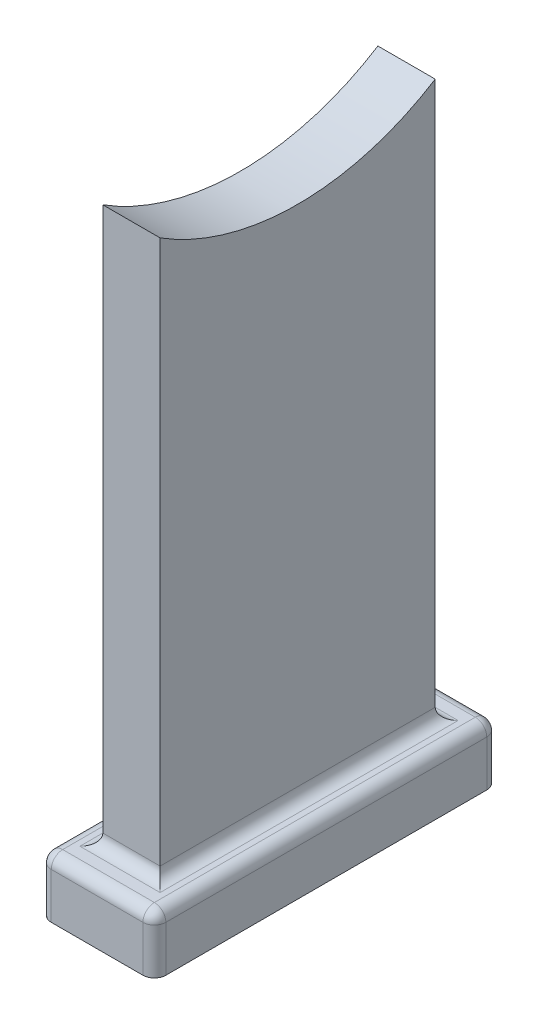
ISO-10303-21;
HEADER;
FILE_DESCRIPTION(('STEP AP214'),'2;1');
FILE_NAME('part.step','',(''),(''),'','','');
FILE_SCHEMA(('AUTOMOTIVE_DESIGN { 1 0 10303 214 1 1 1 1 }'));
ENDSEC;
DATA;
#1=APPLICATION_CONTEXT('core data for automotive mechanical design processes');
#2=APPLICATION_PROTOCOL_DEFINITION('international standard','automotive_design',2000,#1);
#3=PRODUCT_CONTEXT('',#1,'mechanical');
#4=PRODUCT('Part','Part','',(#3));
#5=PRODUCT_RELATED_PRODUCT_CATEGORY('part','',(#4));
#6=PRODUCT_DEFINITION_FORMATION('','',#4);
#7=PRODUCT_DEFINITION_CONTEXT('part definition',#1,'design');
#8=PRODUCT_DEFINITION('design','',#6,#7);
#9=PRODUCT_DEFINITION_SHAPE('','',#8);
#10=(LENGTH_UNIT() NAMED_UNIT(*) SI_UNIT(.MILLI.,.METRE.));
#11=(NAMED_UNIT(*) PLANE_ANGLE_UNIT() SI_UNIT($,.RADIAN.));
#12=(NAMED_UNIT(*) SI_UNIT($,.STERADIAN.) SOLID_ANGLE_UNIT());
#13=UNCERTAINTY_MEASURE_WITH_UNIT(LENGTH_MEASURE(1.E-05),#10,'distance_accuracy_value','');
#14=(GEOMETRIC_REPRESENTATION_CONTEXT(3) GLOBAL_UNCERTAINTY_ASSIGNED_CONTEXT((#13)) GLOBAL_UNIT_ASSIGNED_CONTEXT((#10,
#11,#12)) REPRESENTATION_CONTEXT('',''));
#15=CARTESIAN_POINT('',(0.,0.,0.));
#16=DIRECTION('',(0.,0.,1.));
#17=DIRECTION('',(1.,0.,0.));
#18=AXIS2_PLACEMENT_3D('',#15,#16,#17);
#19=CARTESIAN_POINT('',(-10.,10.,30.));
#20=DIRECTION('',(1.,0.,0.));
#21=DIRECTION('',(0.,0.,-1.));
#22=AXIS2_PLACEMENT_3D('',#19,#20,#21);
#23=PLANE('',#22);
#24=DIRECTION('',(0.,0.,1.));
#25=VECTOR('',#24,1.);
#26=CARTESIAN_POINT('',(-10.,8.,-30.));
#27=LINE('',#26,#25);
#28=CARTESIAN_POINT('',(-10.,8.,28.));
#29=VERTEX_POINT('',#28);
#30=CARTESIAN_POINT('',(-10.,8.,-28.));
#31=VERTEX_POINT('',#30);
#32=EDGE_CURVE('E267',#29,#31,#27,.F.);
#33=ORIENTED_EDGE('',*,*,#32,.T.);
#34=DIRECTION('',(0.,-1.,0.));
#35=VECTOR('',#34,1.);
#36=CARTESIAN_POINT('',(-10.,10.,-28.));
#37=LINE('',#36,#35);
#38=CARTESIAN_POINT('',(-10.,0.,-28.));
#39=VERTEX_POINT('',#38);
#40=EDGE_CURVE('E270',#31,#39,#37,.T.);
#41=ORIENTED_EDGE('',*,*,#40,.T.);
#42=DIRECTION('',(0.,0.,1.));
#43=VECTOR('',#42,1.);
#44=CARTESIAN_POINT('',(-10.,0.,30.));
#45=LINE('',#44,#43);
#46=CARTESIAN_POINT('',(-10.,0.,28.));
#47=VERTEX_POINT('',#46);
#48=EDGE_CURVE('E182',#39,#47,#45,.T.);
#49=ORIENTED_EDGE('',*,*,#48,.T.);
#50=DIRECTION('',(0.,-1.,0.));
#51=VECTOR('',#50,1.);
#52=CARTESIAN_POINT('',(-10.,10.,28.));
#53=LINE('',#52,#51);
#54=EDGE_CURVE('E264',#47,#29,#53,.F.);
#55=ORIENTED_EDGE('',*,*,#54,.T.);
#56=EDGE_LOOP('',(#33,#41,#49,#55));
#57=FACE_BOUND('',#56,.T.);
#58=ADVANCED_FACE('F45',(#57),#23,.F.);
#59=CARTESIAN_POINT('',(10.,10.,30.));
#60=DIRECTION('',(0.,0.,-1.));
#61=DIRECTION('',(-1.,0.,0.));
#62=AXIS2_PLACEMENT_3D('',#59,#60,#61);
#63=PLANE('',#62);
#64=DIRECTION('',(1.,0.,0.));
#65=VECTOR('',#64,1.);
#66=CARTESIAN_POINT('',(10.,0.,30.));
#67=LINE('',#66,#65);
#68=CARTESIAN_POINT('',(-8.,0.,30.));
#69=VERTEX_POINT('',#68);
#70=CARTESIAN_POINT('',(8.,0.,30.));
#71=VERTEX_POINT('',#70);
#72=EDGE_CURVE('E206',#69,#71,#67,.T.);
#73=ORIENTED_EDGE('',*,*,#72,.T.);
#74=DIRECTION('',(0.,-1.,0.));
#75=VECTOR('',#74,1.);
#76=CARTESIAN_POINT('',(8.,10.,30.));
#77=LINE('',#76,#75);
#78=CARTESIAN_POINT('',(8.,8.,30.));
#79=VERTEX_POINT('',#78);
#80=EDGE_CURVE('E279',#71,#79,#77,.F.);
#81=ORIENTED_EDGE('',*,*,#80,.T.);
#82=DIRECTION('',(1.,0.,0.));
#83=VECTOR('',#82,1.);
#84=CARTESIAN_POINT('',(-10.,8.,30.));
#85=LINE('',#84,#83);
#86=CARTESIAN_POINT('',(-8.,8.,30.));
#87=VERTEX_POINT('',#86);
#88=EDGE_CURVE('E276',#79,#87,#85,.F.);
#89=ORIENTED_EDGE('',*,*,#88,.T.);
#90=DIRECTION('',(0.,-1.,0.));
#91=VECTOR('',#90,1.);
#92=CARTESIAN_POINT('',(-8.,10.,30.));
#93=LINE('',#92,#91);
#94=EDGE_CURVE('E273',#87,#69,#93,.T.);
#95=ORIENTED_EDGE('',*,*,#94,.T.);
#96=EDGE_LOOP('',(#73,#81,#89,#95));
#97=FACE_BOUND('',#96,.T.);
#98=ADVANCED_FACE('F376',(#97),#63,.F.);
#99=CARTESIAN_POINT('',(10.,10.,30.));
#100=DIRECTION('',(-1.,0.,0.));
#101=DIRECTION('',(0.,0.,1.));
#102=AXIS2_PLACEMENT_3D('',#99,#100,#101);
#103=PLANE('',#102);
#104=DIRECTION('',(0.,0.,-1.));
#105=VECTOR('',#104,1.);
#106=CARTESIAN_POINT('',(10.,0.,30.));
#107=LINE('',#106,#105);
#108=CARTESIAN_POINT('',(10.,0.,28.));
#109=VERTEX_POINT('',#108);
#110=CARTESIAN_POINT('',(10.,0.,-28.));
#111=VERTEX_POINT('',#110);
#112=EDGE_CURVE('E210',#109,#111,#107,.T.);
#113=ORIENTED_EDGE('',*,*,#112,.T.);
#114=DIRECTION('',(0.,-1.,0.));
#115=VECTOR('',#114,1.);
#116=CARTESIAN_POINT('',(10.,10.,-28.));
#117=LINE('',#116,#115);
#118=CARTESIAN_POINT('',(10.,8.,-28.));
#119=VERTEX_POINT('',#118);
#120=EDGE_CURVE('E63',#111,#119,#117,.F.);
#121=ORIENTED_EDGE('',*,*,#120,.T.);
#122=DIRECTION('',(0.,0.,-1.));
#123=VECTOR('',#122,1.);
#124=CARTESIAN_POINT('',(10.,8.,30.));
#125=LINE('',#124,#123);
#126=CARTESIAN_POINT('',(10.,8.,28.));
#127=VERTEX_POINT('',#126);
#128=EDGE_CURVE('E67',#119,#127,#125,.F.);
#129=ORIENTED_EDGE('',*,*,#128,.T.);
#130=DIRECTION('',(0.,-1.,0.));
#131=VECTOR('',#130,1.);
#132=CARTESIAN_POINT('',(10.,10.,28.));
#133=LINE('',#132,#131);
#134=EDGE_CURVE('E282',#127,#109,#133,.T.);
#135=ORIENTED_EDGE('',*,*,#134,.T.);
#136=EDGE_LOOP('',(#113,#121,#129,#135));
#137=FACE_BOUND('',#136,.T.);
#138=ADVANCED_FACE('F428',(#137),#103,.F.);
#139=CARTESIAN_POINT('',(10.,10.,-30.));
#140=DIRECTION('',(0.,0.,1.));
#141=DIRECTION('',(1.,0.,0.));
#142=AXIS2_PLACEMENT_3D('',#139,#140,#141);
#143=PLANE('',#142);
#144=DIRECTION('',(-1.,0.,0.));
#145=VECTOR('',#144,1.);
#146=CARTESIAN_POINT('',(10.,0.,-30.));
#147=LINE('',#146,#145);
#148=CARTESIAN_POINT('',(8.,0.,-30.));
#149=VERTEX_POINT('',#148);
#150=CARTESIAN_POINT('',(-8.,0.,-30.));
#151=VERTEX_POINT('',#150);
#152=EDGE_CURVE('E213',#149,#151,#147,.T.);
#153=ORIENTED_EDGE('',*,*,#152,.T.);
#154=DIRECTION('',(0.,-1.,0.));
#155=VECTOR('',#154,1.);
#156=CARTESIAN_POINT('',(-8.,10.,-30.));
#157=LINE('',#156,#155);
#158=CARTESIAN_POINT('',(-8.,8.,-30.));
#159=VERTEX_POINT('',#158);
#160=EDGE_CURVE('E261',#151,#159,#157,.F.);
#161=ORIENTED_EDGE('',*,*,#160,.T.);
#162=DIRECTION('',(-1.,0.,0.));
#163=VECTOR('',#162,1.);
#164=CARTESIAN_POINT('',(10.,8.,-30.));
#165=LINE('',#164,#163);
#166=CARTESIAN_POINT('',(8.,8.,-30.));
#167=VERTEX_POINT('',#166);
#168=EDGE_CURVE('E257',#159,#167,#165,.F.);
#169=ORIENTED_EDGE('',*,*,#168,.T.);
#170=DIRECTION('',(0.,-1.,0.));
#171=VECTOR('',#170,1.);
#172=CARTESIAN_POINT('',(8.,10.,-30.));
#173=LINE('',#172,#171);
#174=EDGE_CURVE('E254',#167,#149,#173,.T.);
#175=ORIENTED_EDGE('',*,*,#174,.T.);
#176=EDGE_LOOP('',(#153,#161,#169,#175));
#177=FACE_BOUND('',#176,.T.);
#178=ADVANCED_FACE('F405',(#177),#143,.F.);
#179=CARTESIAN_POINT('',(0.,10.,0.));
#180=DIRECTION('',(0.,1.,0.));
#181=DIRECTION('',(0.,0.,1.));
#182=AXIS2_PLACEMENT_3D('',#179,#180,#181);
#183=PLANE('',#182);
#184=DIRECTION('',(0.,0.,-1.));
#185=VECTOR('',#184,1.);
#186=CARTESIAN_POINT('',(-7.,10.,0.));
#187=LINE('',#186,#185);
#188=CARTESIAN_POINT('',(-7.,10.,26.));
#189=VERTEX_POINT('',#188);
#190=CARTESIAN_POINT('',(-7.,10.,-26.));
#191=VERTEX_POINT('',#190);
#192=EDGE_CURVE('E236',#189,#191,#187,.T.);
#193=ORIENTED_EDGE('',*,*,#192,.T.);
#194=DIRECTION('',(1.,0.,0.));
#195=VECTOR('',#194,1.);
#196=CARTESIAN_POINT('',(0.,10.,-26.));
#197=LINE('',#196,#195);
#198=CARTESIAN_POINT('',(7.,10.,-26.));
#199=VERTEX_POINT('',#198);
#200=EDGE_CURVE('E239',#191,#199,#197,.T.);
#201=ORIENTED_EDGE('',*,*,#200,.T.);
#202=DIRECTION('',(0.,0.,-1.));
#203=VECTOR('',#202,1.);
#204=CARTESIAN_POINT('',(7.,10.,24.));
#205=LINE('',#204,#203);
#206=CARTESIAN_POINT('',(7.,10.,26.));
#207=VERTEX_POINT('',#206);
#208=EDGE_CURVE('E230',#199,#207,#205,.F.);
#209=ORIENTED_EDGE('',*,*,#208,.T.);
#210=DIRECTION('',(-1.,0.,0.));
#211=VECTOR('',#210,1.);
#212=CARTESIAN_POINT('',(0.,10.,26.));
#213=LINE('',#212,#211);
#214=EDGE_CURVE('E233',#207,#189,#213,.T.);
#215=ORIENTED_EDGE('',*,*,#214,.T.);
#216=EDGE_LOOP('',(#193,#201,#209,#215));
#217=FACE_BOUND('',#216,.T.);
#218=DIRECTION('',(0.,0.,-1.));
#219=VECTOR('',#218,1.);
#220=CARTESIAN_POINT('',(8.,10.,-30.));
#221=LINE('',#220,#219);
#222=CARTESIAN_POINT('',(8.,10.,28.));
#223=VERTEX_POINT('',#222);
#224=CARTESIAN_POINT('',(8.,10.,-28.));
#225=VERTEX_POINT('',#224);
#226=EDGE_CURVE('E217',#223,#225,#221,.T.);
#227=ORIENTED_EDGE('',*,*,#226,.T.);
#228=DIRECTION('',(-1.,0.,0.));
#229=VECTOR('',#228,1.);
#230=CARTESIAN_POINT('',(-10.,10.,-28.));
#231=LINE('',#230,#229);
#232=CARTESIAN_POINT('',(-8.,10.,-28.));
#233=VERTEX_POINT('',#232);
#234=EDGE_CURVE('E226',#225,#233,#231,.T.);
#235=ORIENTED_EDGE('',*,*,#234,.T.);
#236=DIRECTION('',(0.,0.,1.));
#237=VECTOR('',#236,1.);
#238=CARTESIAN_POINT('',(-8.,10.,30.));
#239=LINE('',#238,#237);
#240=CARTESIAN_POINT('',(-8.,10.,28.));
#241=VERTEX_POINT('',#240);
#242=EDGE_CURVE('E223',#233,#241,#239,.T.);
#243=ORIENTED_EDGE('',*,*,#242,.T.);
#244=DIRECTION('',(1.,0.,0.));
#245=VECTOR('',#244,1.);
#246=CARTESIAN_POINT('',(10.,10.,28.));
#247=LINE('',#246,#245);
#248=EDGE_CURVE('E220',#241,#223,#247,.T.);
#249=ORIENTED_EDGE('',*,*,#248,.T.);
#250=EDGE_LOOP('',(#227,#235,#243,#249));
#251=FACE_BOUND('',#250,.T.);
#252=ADVANCED_FACE('F366',(#217,#251),#183,.T.);
#253=CARTESIAN_POINT('',(0.,0.,0.));
#254=DIRECTION('',(0.,1.,0.));
#255=DIRECTION('',(0.,0.,1.));
#256=AXIS2_PLACEMENT_3D('',#253,#254,#255);
#257=PLANE('',#256);
#258=ORIENTED_EDGE('',*,*,#48,.F.);
#259=CARTESIAN_POINT('',(-8.,0.,-28.));
#260=DIRECTION('',(0.,1.,0.));
#261=DIRECTION('',(0.,0.,1.));
#262=AXIS2_PLACEMENT_3D('',#259,#260,#261);
#263=CIRCLE('',#262,2.);
#264=EDGE_CURVE('E11',#39,#151,#263,.F.);
#265=ORIENTED_EDGE('',*,*,#264,.T.);
#266=ORIENTED_EDGE('',*,*,#152,.F.);
#267=CARTESIAN_POINT('',(8.,0.,-28.));
#268=DIRECTION('',(0.,1.,0.));
#269=DIRECTION('',(0.,0.,1.));
#270=AXIS2_PLACEMENT_3D('',#267,#268,#269);
#271=CIRCLE('',#270,2.);
#272=EDGE_CURVE('E55',#149,#111,#271,.F.);
#273=ORIENTED_EDGE('',*,*,#272,.T.);
#274=ORIENTED_EDGE('',*,*,#112,.F.);
#275=CARTESIAN_POINT('',(8.,0.,28.));
#276=DIRECTION('',(0.,1.,0.));
#277=DIRECTION('',(0.,0.,1.));
#278=AXIS2_PLACEMENT_3D('',#275,#276,#277);
#279=CIRCLE('',#278,2.);
#280=EDGE_CURVE('E292',#109,#71,#279,.F.);
#281=ORIENTED_EDGE('',*,*,#280,.T.);
#282=ORIENTED_EDGE('',*,*,#72,.F.);
#283=CARTESIAN_POINT('',(-8.,0.,28.));
#284=DIRECTION('',(0.,1.,0.));
#285=DIRECTION('',(0.,0.,1.));
#286=AXIS2_PLACEMENT_3D('',#283,#284,#285);
#287=CIRCLE('',#286,2.);
#288=EDGE_CURVE('E289',#69,#47,#287,.F.);
#289=ORIENTED_EDGE('',*,*,#288,.T.);
#290=EDGE_LOOP('',(#258,#265,#266,#273,#274,#281,#282,#289));
#291=FACE_BOUND('',#290,.T.);
#292=ADVANCED_FACE('F386',(#291),#257,.F.);
#293=CARTESIAN_POINT('',(5.,100.,-24.));
#294=DIRECTION('',(0.,0.,1.));
#295=DIRECTION('',(1.,0.,0.));
#296=AXIS2_PLACEMENT_3D('',#293,#294,#295);
#297=PLANE('',#296);
#298=DIRECTION('',(0.,1.,0.));
#299=VECTOR('',#298,1.);
#300=CARTESIAN_POINT('',(5.,0.,-24.));
#301=LINE('',#300,#299);
#302=CARTESIAN_POINT('',(5.,12.,-24.));
#303=VERTEX_POINT('',#302);
#304=CARTESIAN_POINT('',(5.,106.934267378651,-24.));
#305=VERTEX_POINT('',#304);
#306=EDGE_CURVE('E159',#303,#305,#301,.T.);
#307=ORIENTED_EDGE('',*,*,#306,.F.);
#308=DIRECTION('',(1.,0.,0.));
#309=VECTOR('',#308,1.);
#310=CARTESIAN_POINT('',(5.,12.,-24.));
#311=LINE('',#310,#309);
#312=CARTESIAN_POINT('',(-5.,12.,-24.));
#313=VERTEX_POINT('',#312);
#314=EDGE_CURVE('E243',#303,#313,#311,.F.);
#315=ORIENTED_EDGE('',*,*,#314,.T.);
#316=DIRECTION('',(0.,1.,0.));
#317=VECTOR('',#316,1.);
#318=CARTESIAN_POINT('',(-5.,100.,-24.));
#319=LINE('',#318,#317);
#320=CARTESIAN_POINT('',(-5.,106.934267378651,-24.));
#321=VERTEX_POINT('',#320);
#322=EDGE_CURVE('E178',#313,#321,#319,.T.);
#323=ORIENTED_EDGE('',*,*,#322,.T.);
#324=DIRECTION('',(-1.,0.,0.));
#325=VECTOR('',#324,1.);
#326=CARTESIAN_POINT('',(5.,106.934267378651,-24.));
#327=LINE('',#326,#325);
#328=EDGE_CURVE('E175',#305,#321,#327,.T.);
#329=ORIENTED_EDGE('',*,*,#328,.F.);
#330=EDGE_LOOP('',(#307,#315,#323,#329));
#331=FACE_BOUND('',#330,.T.);
#332=ADVANCED_FACE('F176',(#331),#297,.F.);
#333=CARTESIAN_POINT('',(5.,145.,0.));
#334=DIRECTION('',(-1.,0.,0.));
#335=DIRECTION('',(0.,0.,1.));
#336=AXIS2_PLACEMENT_3D('',#333,#334,#335);
#337=CYLINDRICAL_SURFACE('',#336,45.);
#338=CARTESIAN_POINT('',(-5.,145.,0.));
#339=DIRECTION('',(-1.,0.,0.));
#340=DIRECTION('',(0.,0.,-1.));
#341=AXIS2_PLACEMENT_3D('',#338,#339,#340);
#342=CIRCLE('',#341,45.);
#343=CARTESIAN_POINT('',(-5.,106.934267378651,24.));
#344=VERTEX_POINT('',#343);
#345=EDGE_CURVE('E195',#321,#344,#342,.T.);
#346=ORIENTED_EDGE('',*,*,#345,.T.);
#347=DIRECTION('',(-1.,0.,0.));
#348=VECTOR('',#347,1.);
#349=CARTESIAN_POINT('',(5.,106.934267378651,24.));
#350=LINE('',#349,#348);
#351=CARTESIAN_POINT('',(5.,106.934267378651,24.));
#352=VERTEX_POINT('',#351);
#353=EDGE_CURVE('E183',#352,#344,#350,.T.);
#354=ORIENTED_EDGE('',*,*,#353,.F.);
#355=CARTESIAN_POINT('',(5.,145.,0.));
#356=DIRECTION('',(-1.,0.,0.));
#357=DIRECTION('',(0.,0.,-1.));
#358=AXIS2_PLACEMENT_3D('',#355,#356,#357);
#359=CIRCLE('',#358,45.);
#360=EDGE_CURVE('E164',#305,#352,#359,.T.);
#361=ORIENTED_EDGE('',*,*,#360,.F.);
#362=ORIENTED_EDGE('',*,*,#328,.T.);
#363=EDGE_LOOP('',(#346,#354,#361,#362));
#364=FACE_BOUND('',#363,.T.);
#365=ADVANCED_FACE('F185',(#364),#337,.F.);
#366=CARTESIAN_POINT('',(5.,106.934267378651,24.));
#367=DIRECTION('',(0.,0.,-1.));
#368=DIRECTION('',(-1.,0.,0.));
#369=AXIS2_PLACEMENT_3D('',#366,#367,#368);
#370=PLANE('',#369);
#371=DIRECTION('',(0.,-1.,0.));
#372=VECTOR('',#371,1.);
#373=CARTESIAN_POINT('',(-5.,106.934267378651,24.));
#374=LINE('',#373,#372);
#375=CARTESIAN_POINT('',(-5.,12.,24.));
#376=VERTEX_POINT('',#375);
#377=EDGE_CURVE('E199',#344,#376,#374,.T.);
#378=ORIENTED_EDGE('',*,*,#377,.T.);
#379=DIRECTION('',(-1.,0.,0.));
#380=VECTOR('',#379,1.);
#381=CARTESIAN_POINT('',(5.,12.,24.));
#382=LINE('',#381,#380);
#383=CARTESIAN_POINT('',(5.,12.,24.));
#384=VERTEX_POINT('',#383);
#385=EDGE_CURVE('E249',#376,#384,#382,.F.);
#386=ORIENTED_EDGE('',*,*,#385,.T.);
#387=DIRECTION('',(0.,-1.,0.));
#388=VECTOR('',#387,1.);
#389=CARTESIAN_POINT('',(5.,0.,24.));
#390=LINE('',#389,#388);
#391=EDGE_CURVE('E172',#352,#384,#390,.T.);
#392=ORIENTED_EDGE('',*,*,#391,.F.);
#393=ORIENTED_EDGE('',*,*,#353,.T.);
#394=EDGE_LOOP('',(#378,#386,#392,#393));
#395=FACE_BOUND('',#394,.T.);
#396=ADVANCED_FACE('F574',(#395),#370,.F.);
#397=CARTESIAN_POINT('',(5.,145.,0.));
#398=DIRECTION('',(1.,0.,0.));
#399=DIRECTION('',(0.,0.,-1.));
#400=AXIS2_PLACEMENT_3D('',#397,#398,#399);
#401=PLANE('',#400);
#402=ORIENTED_EDGE('',*,*,#391,.T.);
#403=DIRECTION('',(0.,0.,-1.));
#404=VECTOR('',#403,1.);
#405=CARTESIAN_POINT('',(5.,12.,-24.));
#406=LINE('',#405,#404);
#407=EDGE_CURVE('E167',#384,#303,#406,.T.);
#408=ORIENTED_EDGE('',*,*,#407,.T.);
#409=ORIENTED_EDGE('',*,*,#306,.T.);
#410=ORIENTED_EDGE('',*,*,#360,.T.);
#411=EDGE_LOOP('',(#402,#408,#409,#410));
#412=FACE_BOUND('',#411,.T.);
#413=ADVANCED_FACE('F162',(#412),#401,.T.);
#414=CARTESIAN_POINT('',(-5.,145.,0.));
#415=DIRECTION('',(1.,0.,0.));
#416=DIRECTION('',(0.,0.,-1.));
#417=AXIS2_PLACEMENT_3D('',#414,#415,#416);
#418=PLANE('',#417);
#419=ORIENTED_EDGE('',*,*,#322,.F.);
#420=DIRECTION('',(0.,0.,-1.));
#421=VECTOR('',#420,1.);
#422=CARTESIAN_POINT('',(-5.,12.,0.));
#423=LINE('',#422,#421);
#424=EDGE_CURVE('E246',#313,#376,#423,.F.);
#425=ORIENTED_EDGE('',*,*,#424,.T.);
#426=ORIENTED_EDGE('',*,*,#377,.F.);
#427=ORIENTED_EDGE('',*,*,#345,.F.);
#428=EDGE_LOOP('',(#419,#425,#426,#427));
#429=FACE_BOUND('',#428,.T.);
#430=ADVANCED_FACE('F447',(#429),#418,.F.);
#431=CARTESIAN_POINT('',(0.,12.,26.));
#432=DIRECTION('',(-1.,0.,0.));
#433=DIRECTION('',(0.,0.,1.));
#434=AXIS2_PLACEMENT_3D('',#431,#432,#433);
#435=CYLINDRICAL_SURFACE('',#434,2.);
#436=CARTESIAN_POINT('',(7.,12.,26.));
#437=DIRECTION('',(-0.707106781186547,0.,0.707106781186547));
#438=DIRECTION('',(0.707106781186547,0.,0.707106781186547));
#439=AXIS2_PLACEMENT_3D('',#436,#437,#438);
#440=ELLIPSE('',#439,2.82842712474619,2.);
#441=EDGE_CURVE('E303',#384,#207,#440,.T.);
#442=ORIENTED_EDGE('',*,*,#441,.F.);
#443=ORIENTED_EDGE('',*,*,#385,.F.);
#444=CARTESIAN_POINT('',(-7.,12.,26.));
#445=DIRECTION('',(-0.707106781186547,0.,-0.707106781186547));
#446=DIRECTION('',(-0.707106781186547,0.,0.707106781186547));
#447=AXIS2_PLACEMENT_3D('',#444,#445,#446);
#448=ELLIPSE('',#447,2.82842712474619,2.);
#449=EDGE_CURVE('E196',#189,#376,#448,.F.);
#450=ORIENTED_EDGE('',*,*,#449,.F.);
#451=ORIENTED_EDGE('',*,*,#214,.F.);
#452=EDGE_LOOP('',(#442,#443,#450,#451));
#453=FACE_BOUND('',#452,.T.);
#454=ADVANCED_FACE('F443',(#453),#435,.F.);
#455=CARTESIAN_POINT('',(-7.,12.,0.));
#456=DIRECTION('',(0.,0.,-1.));
#457=DIRECTION('',(-1.,0.,0.));
#458=AXIS2_PLACEMENT_3D('',#455,#456,#457);
#459=CYLINDRICAL_SURFACE('',#458,2.);
#460=ORIENTED_EDGE('',*,*,#449,.T.);
#461=ORIENTED_EDGE('',*,*,#424,.F.);
#462=CARTESIAN_POINT('',(-7.,12.,-26.));
#463=DIRECTION('',(0.707106781186547,0.,-0.707106781186547));
#464=DIRECTION('',(-0.707106781186547,0.,-0.707106781186547));
#465=AXIS2_PLACEMENT_3D('',#462,#463,#464);
#466=ELLIPSE('',#465,2.82842712474619,2.);
#467=EDGE_CURVE('E300',#191,#313,#466,.F.);
#468=ORIENTED_EDGE('',*,*,#467,.F.);
#469=ORIENTED_EDGE('',*,*,#192,.F.);
#470=EDGE_LOOP('',(#460,#461,#468,#469));
#471=FACE_BOUND('',#470,.T.);
#472=ADVANCED_FACE('F439',(#471),#459,.F.);
#473=CARTESIAN_POINT('',(7.,12.,0.));
#474=DIRECTION('',(0.,0.,1.));
#475=DIRECTION('',(1.,0.,0.));
#476=AXIS2_PLACEMENT_3D('',#473,#474,#475);
#477=CYLINDRICAL_SURFACE('',#476,2.);
#478=ORIENTED_EDGE('',*,*,#441,.T.);
#479=ORIENTED_EDGE('',*,*,#208,.F.);
#480=CARTESIAN_POINT('',(7.,12.,-26.));
#481=DIRECTION('',(0.707106781186547,0.,0.707106781186547));
#482=DIRECTION('',(-0.707106781186547,0.,0.707106781186547));
#483=AXIS2_PLACEMENT_3D('',#480,#481,#482);
#484=ELLIPSE('',#483,2.82842712474619,2.);
#485=EDGE_CURVE('E297',#303,#199,#484,.T.);
#486=ORIENTED_EDGE('',*,*,#485,.F.);
#487=ORIENTED_EDGE('',*,*,#407,.F.);
#488=EDGE_LOOP('',(#478,#479,#486,#487));
#489=FACE_BOUND('',#488,.T.);
#490=ADVANCED_FACE('F435',(#489),#477,.F.);
#491=CARTESIAN_POINT('',(0.,12.,-26.));
#492=DIRECTION('',(1.,0.,0.));
#493=DIRECTION('',(0.,0.,-1.));
#494=AXIS2_PLACEMENT_3D('',#491,#492,#493);
#495=CYLINDRICAL_SURFACE('',#494,2.);
#496=ORIENTED_EDGE('',*,*,#467,.T.);
#497=ORIENTED_EDGE('',*,*,#314,.F.);
#498=ORIENTED_EDGE('',*,*,#485,.T.);
#499=ORIENTED_EDGE('',*,*,#200,.F.);
#500=EDGE_LOOP('',(#496,#497,#498,#499));
#501=FACE_BOUND('',#500,.T.);
#502=ADVANCED_FACE('F432',(#501),#495,.F.);
#503=CARTESIAN_POINT('',(8.,10.,28.));
#504=DIRECTION('',(0.,-1.,0.));
#505=DIRECTION('',(0.,0.,-1.));
#506=AXIS2_PLACEMENT_3D('',#503,#504,#505);
#507=CYLINDRICAL_SURFACE('',#506,2.);
#508=ORIENTED_EDGE('',*,*,#280,.F.);
#509=ORIENTED_EDGE('',*,*,#134,.F.);
#510=CARTESIAN_POINT('',(8.,8.,28.));
#511=DIRECTION('',(0.,1.,0.));
#512=DIRECTION('',(0.,0.,1.));
#513=AXIS2_PLACEMENT_3D('',#510,#511,#512);
#514=CIRCLE('',#513,2.);
#515=EDGE_CURVE('E49',#79,#127,#514,.T.);
#516=ORIENTED_EDGE('',*,*,#515,.F.);
#517=ORIENTED_EDGE('',*,*,#80,.F.);
#518=EDGE_LOOP('',(#508,#509,#516,#517));
#519=FACE_BOUND('',#518,.T.);
#520=ADVANCED_FACE('F47',(#519),#507,.T.);
#521=CARTESIAN_POINT('',(0.,8.,28.));
#522=DIRECTION('',(-1.,0.,0.));
#523=DIRECTION('',(0.,0.,1.));
#524=AXIS2_PLACEMENT_3D('',#521,#522,#523);
#525=CYLINDRICAL_SURFACE('',#524,2.);
#526=CARTESIAN_POINT('',(-8.,8.,28.));
#527=DIRECTION('',(-1.,0.,0.));
#528=DIRECTION('',(0.,-1.,0.));
#529=AXIS2_PLACEMENT_3D('',#526,#527,#528);
#530=CIRCLE('',#529,2.);
#531=EDGE_CURVE('E344',#87,#241,#530,.T.);
#532=ORIENTED_EDGE('',*,*,#531,.F.);
#533=ORIENTED_EDGE('',*,*,#88,.F.);
#534=CARTESIAN_POINT('',(8.,8.,28.));
#535=DIRECTION('',(1.,0.,0.));
#536=DIRECTION('',(0.,0.,-1.));
#537=AXIS2_PLACEMENT_3D('',#534,#535,#536);
#538=CIRCLE('',#537,2.);
#539=EDGE_CURVE('E347',#223,#79,#538,.T.);
#540=ORIENTED_EDGE('',*,*,#539,.F.);
#541=ORIENTED_EDGE('',*,*,#248,.F.);
#542=EDGE_LOOP('',(#532,#533,#540,#541));
#543=FACE_BOUND('',#542,.T.);
#544=ADVANCED_FACE('F373',(#543),#525,.T.);
#545=CARTESIAN_POINT('',(-8.,10.,28.));
#546=DIRECTION('',(0.,-1.,0.));
#547=DIRECTION('',(0.,0.,-1.));
#548=AXIS2_PLACEMENT_3D('',#545,#546,#547);
#549=CYLINDRICAL_SURFACE('',#548,2.);
#550=ORIENTED_EDGE('',*,*,#288,.F.);
#551=ORIENTED_EDGE('',*,*,#94,.F.);
#552=CARTESIAN_POINT('',(-8.,8.,28.));
#553=DIRECTION('',(0.,1.,0.));
#554=DIRECTION('',(0.,0.,1.));
#555=AXIS2_PLACEMENT_3D('',#552,#553,#554);
#556=CIRCLE('',#555,2.);
#557=EDGE_CURVE('E340',#29,#87,#556,.T.);
#558=ORIENTED_EDGE('',*,*,#557,.F.);
#559=ORIENTED_EDGE('',*,*,#54,.F.);
#560=EDGE_LOOP('',(#550,#551,#558,#559));
#561=FACE_BOUND('',#560,.T.);
#562=ADVANCED_FACE('F381',(#561),#549,.T.);
#563=CARTESIAN_POINT('',(8.,8.,28.));
#564=DIRECTION('',(0.,0.,1.));
#565=DIRECTION('',(1.,0.,0.));
#566=AXIS2_PLACEMENT_3D('',#563,#564,#565);
#567=SPHERICAL_SURFACE('',#566,2.);
#568=ORIENTED_EDGE('',*,*,#539,.T.);
#569=ORIENTED_EDGE('',*,*,#515,.T.);
#570=CARTESIAN_POINT('',(8.,8.,28.));
#571=DIRECTION('',(0.,0.,1.));
#572=DIRECTION('',(1.,0.,0.));
#573=AXIS2_PLACEMENT_3D('',#570,#571,#572);
#574=CIRCLE('',#573,2.);
#575=EDGE_CURVE('E336',#223,#127,#574,.F.);
#576=ORIENTED_EDGE('',*,*,#575,.F.);
#577=EDGE_LOOP('',(#568,#569,#576));
#578=FACE_BOUND('',#577,.T.);
#579=ADVANCED_FACE('F356',(#578),#567,.T.);
#580=CARTESIAN_POINT('',(-8.,8.,28.));
#581=DIRECTION('',(0.,0.,1.));
#582=DIRECTION('',(1.,0.,0.));
#583=AXIS2_PLACEMENT_3D('',#580,#581,#582);
#584=SPHERICAL_SURFACE('',#583,2.);
#585=ORIENTED_EDGE('',*,*,#557,.T.);
#586=ORIENTED_EDGE('',*,*,#531,.T.);
#587=CARTESIAN_POINT('',(-8.,8.,28.));
#588=DIRECTION('',(0.,0.,1.));
#589=DIRECTION('',(1.,0.,0.));
#590=AXIS2_PLACEMENT_3D('',#587,#588,#589);
#591=CIRCLE('',#590,2.);
#592=EDGE_CURVE('E332',#29,#241,#591,.F.);
#593=ORIENTED_EDGE('',*,*,#592,.F.);
#594=EDGE_LOOP('',(#585,#586,#593));
#595=FACE_BOUND('',#594,.T.);
#596=ADVANCED_FACE('F493',(#595),#584,.T.);
#597=CARTESIAN_POINT('',(8.,10.,-28.));
#598=DIRECTION('',(0.,-1.,0.));
#599=DIRECTION('',(0.,0.,-1.));
#600=AXIS2_PLACEMENT_3D('',#597,#598,#599);
#601=CYLINDRICAL_SURFACE('',#600,2.);
#602=ORIENTED_EDGE('',*,*,#272,.F.);
#603=ORIENTED_EDGE('',*,*,#174,.F.);
#604=CARTESIAN_POINT('',(8.,8.,-28.));
#605=DIRECTION('',(0.,1.,0.));
#606=DIRECTION('',(0.,0.,1.));
#607=AXIS2_PLACEMENT_3D('',#604,#605,#606);
#608=CIRCLE('',#607,2.);
#609=EDGE_CURVE('E328',#119,#167,#608,.T.);
#610=ORIENTED_EDGE('',*,*,#609,.F.);
#611=ORIENTED_EDGE('',*,*,#120,.F.);
#612=EDGE_LOOP('',(#602,#603,#610,#611));
#613=FACE_BOUND('',#612,.T.);
#614=ADVANCED_FACE('F411',(#613),#601,.T.);
#615=CARTESIAN_POINT('',(8.,8.,0.));
#616=DIRECTION('',(0.,0.,1.));
#617=DIRECTION('',(1.,0.,0.));
#618=AXIS2_PLACEMENT_3D('',#615,#616,#617);
#619=CYLINDRICAL_SURFACE('',#618,2.);
#620=ORIENTED_EDGE('',*,*,#575,.T.);
#621=ORIENTED_EDGE('',*,*,#128,.F.);
#622=CARTESIAN_POINT('',(8.,8.,-28.));
#623=DIRECTION('',(0.,0.,-1.));
#624=DIRECTION('',(-1.,0.,0.));
#625=AXIS2_PLACEMENT_3D('',#622,#623,#624);
#626=CIRCLE('',#625,2.);
#627=EDGE_CURVE('E324',#225,#119,#626,.T.);
#628=ORIENTED_EDGE('',*,*,#627,.F.);
#629=ORIENTED_EDGE('',*,*,#226,.F.);
#630=EDGE_LOOP('',(#620,#621,#628,#629));
#631=FACE_BOUND('',#630,.T.);
#632=ADVANCED_FACE('F361',(#631),#619,.T.);
#633=CARTESIAN_POINT('',(-8.,8.,0.));
#634=DIRECTION('',(0.,0.,-1.));
#635=DIRECTION('',(-1.,0.,0.));
#636=AXIS2_PLACEMENT_3D('',#633,#634,#635);
#637=CYLINDRICAL_SURFACE('',#636,2.);
#638=ORIENTED_EDGE('',*,*,#592,.T.);
#639=ORIENTED_EDGE('',*,*,#242,.F.);
#640=CARTESIAN_POINT('',(-8.,8.,-28.));
#641=DIRECTION('',(0.,0.,-1.));
#642=DIRECTION('',(0.,1.,0.));
#643=AXIS2_PLACEMENT_3D('',#640,#641,#642);
#644=CIRCLE('',#643,2.);
#645=EDGE_CURVE('E320',#31,#233,#644,.T.);
#646=ORIENTED_EDGE('',*,*,#645,.F.);
#647=ORIENTED_EDGE('',*,*,#32,.F.);
#648=EDGE_LOOP('',(#638,#639,#646,#647));
#649=FACE_BOUND('',#648,.T.);
#650=ADVANCED_FACE('F398',(#649),#637,.T.);
#651=CARTESIAN_POINT('',(-8.,10.,-28.));
#652=DIRECTION('',(0.,-1.,0.));
#653=DIRECTION('',(0.,0.,-1.));
#654=AXIS2_PLACEMENT_3D('',#651,#652,#653);
#655=CYLINDRICAL_SURFACE('',#654,2.);
#656=ORIENTED_EDGE('',*,*,#264,.F.);
#657=ORIENTED_EDGE('',*,*,#40,.F.);
#658=CARTESIAN_POINT('',(-8.,8.,-28.));
#659=DIRECTION('',(0.,1.,0.));
#660=DIRECTION('',(0.,0.,1.));
#661=AXIS2_PLACEMENT_3D('',#658,#659,#660);
#662=CIRCLE('',#661,2.);
#663=EDGE_CURVE('E316',#159,#31,#662,.T.);
#664=ORIENTED_EDGE('',*,*,#663,.F.);
#665=ORIENTED_EDGE('',*,*,#160,.F.);
#666=EDGE_LOOP('',(#656,#657,#664,#665));
#667=FACE_BOUND('',#666,.T.);
#668=ADVANCED_FACE('F394',(#667),#655,.T.);
#669=CARTESIAN_POINT('',(8.,8.,-28.));
#670=DIRECTION('',(1.,0.,0.));
#671=DIRECTION('',(0.,0.,-1.));
#672=AXIS2_PLACEMENT_3D('',#669,#670,#671);
#673=SPHERICAL_SURFACE('',#672,2.);
#674=ORIENTED_EDGE('',*,*,#627,.T.);
#675=ORIENTED_EDGE('',*,*,#609,.T.);
#676=CARTESIAN_POINT('',(8.,8.,-28.));
#677=DIRECTION('',(1.,0.,0.));
#678=DIRECTION('',(0.,0.,-1.));
#679=AXIS2_PLACEMENT_3D('',#676,#677,#678);
#680=CIRCLE('',#679,2.);
#681=EDGE_CURVE('E313',#225,#167,#680,.F.);
#682=ORIENTED_EDGE('',*,*,#681,.F.);
#683=EDGE_LOOP('',(#674,#675,#682));
#684=FACE_BOUND('',#683,.T.);
#685=ADVANCED_FACE('F413',(#684),#673,.T.);
#686=CARTESIAN_POINT('',(-8.,8.,-28.));
#687=DIRECTION('',(-1.,0.,0.));
#688=DIRECTION('',(0.,0.,1.));
#689=AXIS2_PLACEMENT_3D('',#686,#687,#688);
#690=SPHERICAL_SURFACE('',#689,2.);
#691=ORIENTED_EDGE('',*,*,#663,.T.);
#692=ORIENTED_EDGE('',*,*,#645,.T.);
#693=CARTESIAN_POINT('',(-8.,8.,-28.));
#694=DIRECTION('',(-1.,0.,0.));
#695=DIRECTION('',(0.,0.,1.));
#696=AXIS2_PLACEMENT_3D('',#693,#694,#695);
#697=CIRCLE('',#696,2.);
#698=EDGE_CURVE('E310',#159,#233,#697,.F.);
#699=ORIENTED_EDGE('',*,*,#698,.F.);
#700=EDGE_LOOP('',(#691,#692,#699));
#701=FACE_BOUND('',#700,.T.);
#702=ADVANCED_FACE('F401',(#701),#690,.T.);
#703=CARTESIAN_POINT('',(0.,8.,-28.));
#704=DIRECTION('',(1.,0.,0.));
#705=DIRECTION('',(0.,0.,-1.));
#706=AXIS2_PLACEMENT_3D('',#703,#704,#705);
#707=CYLINDRICAL_SURFACE('',#706,2.);
#708=ORIENTED_EDGE('',*,*,#681,.T.);
#709=ORIENTED_EDGE('',*,*,#168,.F.);
#710=ORIENTED_EDGE('',*,*,#698,.T.);
#711=ORIENTED_EDGE('',*,*,#234,.F.);
#712=EDGE_LOOP('',(#708,#709,#710,#711));
#713=FACE_BOUND('',#712,.T.);
#714=ADVANCED_FACE('F403',(#713),#707,.T.);
#715=CLOSED_SHELL('',(#58,#98,#138,#178,#252,#292,#332,#365,#396,#413,#430,#454,#472,#490,#502,
#520,#544,#562,#579,#596,#614,#632,#650,#668,#685,#702,#714));
#716=MANIFOLD_SOLID_BREP('B2',#715);
#717=ADVANCED_BREP_SHAPE_REPRESENTATION('',(#18,#716),#14);
#718=SHAPE_DEFINITION_REPRESENTATION(#9,#717);
ENDSEC;
END-ISO-10303-21;
